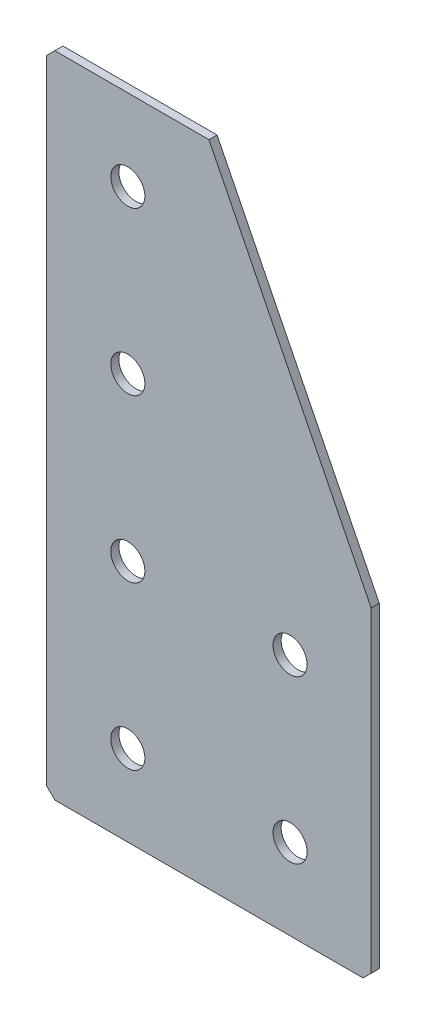
ISO-10303-21;
HEADER;
FILE_DESCRIPTION(('STEP AP214'),'2;1');
FILE_NAME('part.step','',(''),(''),'','','');
FILE_SCHEMA(('AUTOMOTIVE_DESIGN { 1 0 10303 214 1 1 1 1 }'));
ENDSEC;
DATA;
#1=APPLICATION_CONTEXT('core data for automotive mechanical design processes');
#2=APPLICATION_PROTOCOL_DEFINITION('international standard','automotive_design',2000,#1);
#3=PRODUCT_CONTEXT('',#1,'mechanical');
#4=PRODUCT('Part','Part','',(#3));
#5=PRODUCT_RELATED_PRODUCT_CATEGORY('part','',(#4));
#6=PRODUCT_DEFINITION_FORMATION('','',#4);
#7=PRODUCT_DEFINITION_CONTEXT('part definition',#1,'design');
#8=PRODUCT_DEFINITION('design','',#6,#7);
#9=PRODUCT_DEFINITION_SHAPE('','',#8);
#10=(LENGTH_UNIT() NAMED_UNIT(*) SI_UNIT(.MILLI.,.METRE.));
#11=(NAMED_UNIT(*) PLANE_ANGLE_UNIT() SI_UNIT($,.RADIAN.));
#12=(NAMED_UNIT(*) SI_UNIT($,.STERADIAN.) SOLID_ANGLE_UNIT());
#13=UNCERTAINTY_MEASURE_WITH_UNIT(LENGTH_MEASURE(1.E-05),#10,'distance_accuracy_value','');
#14=(GEOMETRIC_REPRESENTATION_CONTEXT(3) GLOBAL_UNCERTAINTY_ASSIGNED_CONTEXT((#13)) GLOBAL_UNIT_ASSIGNED_CONTEXT((#10,
#11,#12)) REPRESENTATION_CONTEXT('',''));
#15=CARTESIAN_POINT('',(0.,0.,0.));
#16=DIRECTION('',(0.,0.,1.));
#17=DIRECTION('',(1.,0.,0.));
#18=AXIS2_PLACEMENT_3D('',#15,#16,#17);
#19=CARTESIAN_POINT('',(0.,0.,-2.));
#20=DIRECTION('',(0.,0.,1.));
#21=DIRECTION('',(1.,0.,0.));
#22=AXIS2_PLACEMENT_3D('',#19,#20,#21);
#23=PLANE('',#22);
#24=CARTESIAN_POINT('',(20.,-100.,-2.00000000000001));
#25=DIRECTION('',(0.,0.,-1.));
#26=DIRECTION('',(0.,1.,0.));
#27=AXIS2_PLACEMENT_3D('',#24,#25,#26);
#28=CIRCLE('',#27,4.2);
#29=CARTESIAN_POINT('',(20.,-95.8,-2.00000000000001));
#30=VERTEX_POINT('',#29);
#31=EDGE_CURVE('E200',#30,#30,#28,.T.);
#32=ORIENTED_EDGE('',*,*,#31,.F.);
#33=EDGE_LOOP('',(#32));
#34=FACE_BOUND('',#33,.T.);
#35=CARTESIAN_POINT('',(20.,-60.,-2.));
#36=DIRECTION('',(0.,0.,-1.));
#37=DIRECTION('',(0.,1.,0.));
#38=AXIS2_PLACEMENT_3D('',#35,#36,#37);
#39=CIRCLE('',#38,4.2);
#40=CARTESIAN_POINT('',(20.,-55.8,-2.));
#41=VERTEX_POINT('',#40);
#42=EDGE_CURVE('E194',#41,#41,#39,.T.);
#43=ORIENTED_EDGE('',*,*,#42,.F.);
#44=EDGE_LOOP('',(#43));
#45=FACE_BOUND('',#44,.T.);
#46=CARTESIAN_POINT('',(20.,-20.,-2.));
#47=DIRECTION('',(0.,0.,-1.));
#48=DIRECTION('',(0.,1.,0.));
#49=AXIS2_PLACEMENT_3D('',#46,#47,#48);
#50=CIRCLE('',#49,4.2);
#51=CARTESIAN_POINT('',(20.,-15.8,-2.));
#52=VERTEX_POINT('',#51);
#53=EDGE_CURVE('E188',#52,#52,#50,.T.);
#54=ORIENTED_EDGE('',*,*,#53,.F.);
#55=EDGE_LOOP('',(#54));
#56=FACE_BOUND('',#55,.T.);
#57=CARTESIAN_POINT('',(60.,-140.,-2.00000000000001));
#58=DIRECTION('',(0.,0.,-1.));
#59=DIRECTION('',(0.,1.,0.));
#60=AXIS2_PLACEMENT_3D('',#57,#58,#59);
#61=CIRCLE('',#60,4.2);
#62=CARTESIAN_POINT('',(60.,-135.8,-2.00000000000001));
#63=VERTEX_POINT('',#62);
#64=EDGE_CURVE('E182',#63,#63,#61,.T.);
#65=ORIENTED_EDGE('',*,*,#64,.F.);
#66=EDGE_LOOP('',(#65));
#67=FACE_BOUND('',#66,.T.);
#68=CARTESIAN_POINT('',(60.,-100.,-2.00000000000001));
#69=DIRECTION('',(0.,0.,-1.));
#70=DIRECTION('',(0.,1.,0.));
#71=AXIS2_PLACEMENT_3D('',#68,#69,#70);
#72=CIRCLE('',#71,4.2);
#73=CARTESIAN_POINT('',(60.,-95.8,-2.00000000000001));
#74=VERTEX_POINT('',#73);
#75=EDGE_CURVE('E176',#74,#74,#72,.T.);
#76=ORIENTED_EDGE('',*,*,#75,.F.);
#77=EDGE_LOOP('',(#76));
#78=FACE_BOUND('',#77,.T.);
#79=DIRECTION('',(0.,1.,0.));
#80=VECTOR('',#79,1.);
#81=CARTESIAN_POINT('',(0.,0.,-2.));
#82=LINE('',#81,#80);
#83=CARTESIAN_POINT('',(0.,-158.,-2.));
#84=VERTEX_POINT('',#83);
#85=CARTESIAN_POINT('',(0.,-2.00000000000003,-2.));
#86=VERTEX_POINT('',#85);
#87=EDGE_CURVE('E132',#84,#86,#82,.T.);
#88=ORIENTED_EDGE('',*,*,#87,.T.);
#89=DIRECTION('',(-0.707106781186543,-0.707106781186552,0.));
#90=VECTOR('',#89,1.);
#91=CARTESIAN_POINT('',(2.,0.,-2.));
#92=LINE('',#91,#90);
#93=CARTESIAN_POINT('',(2.,0.,-2.));
#94=VERTEX_POINT('',#93);
#95=EDGE_CURVE('E108',#86,#94,#92,.F.);
#96=ORIENTED_EDGE('',*,*,#95,.T.);
#97=DIRECTION('',(1.,0.,0.));
#98=VECTOR('',#97,1.);
#99=CARTESIAN_POINT('',(40.,0.,-2.));
#100=LINE('',#99,#98);
#101=CARTESIAN_POINT('',(40.,0.,-2.));
#102=VERTEX_POINT('',#101);
#103=EDGE_CURVE('E101',#94,#102,#100,.T.);
#104=ORIENTED_EDGE('',*,*,#103,.T.);
#105=DIRECTION('',(0.447213595499958,-0.894427190999916,0.));
#106=VECTOR('',#105,1.);
#107=CARTESIAN_POINT('',(80.,-80.,-2.));
#108=LINE('',#107,#106);
#109=CARTESIAN_POINT('',(80.,-80.,-2.));
#110=VERTEX_POINT('',#109);
#111=EDGE_CURVE('E105',#102,#110,#108,.T.);
#112=ORIENTED_EDGE('',*,*,#111,.T.);
#113=DIRECTION('',(0.,-1.,0.));
#114=VECTOR('',#113,1.);
#115=CARTESIAN_POINT('',(80.,-160.,-2.));
#116=LINE('',#115,#114);
#117=CARTESIAN_POINT('',(80.,-158.,-2.));
#118=VERTEX_POINT('',#117);
#119=EDGE_CURVE('E122',#110,#118,#116,.T.);
#120=ORIENTED_EDGE('',*,*,#119,.T.);
#121=DIRECTION('',(0.707106781186548,0.707106781186548,0.));
#122=VECTOR('',#121,1.);
#123=CARTESIAN_POINT('',(78.,-160.,-2.));
#124=LINE('',#123,#122);
#125=CARTESIAN_POINT('',(78.,-160.,-2.));
#126=VERTEX_POINT('',#125);
#127=EDGE_CURVE('E59',#118,#126,#124,.F.);
#128=ORIENTED_EDGE('',*,*,#127,.T.);
#129=DIRECTION('',(-1.,0.,0.));
#130=VECTOR('',#129,1.);
#131=CARTESIAN_POINT('',(0.,-160.,-2.));
#132=LINE('',#131,#130);
#133=CARTESIAN_POINT('',(2.00000000000003,-160.,-2.));
#134=VERTEX_POINT('',#133);
#135=EDGE_CURVE('E155',#126,#134,#132,.T.);
#136=ORIENTED_EDGE('',*,*,#135,.T.);
#137=DIRECTION('',(0.707106781186548,-0.707106781186548,0.));
#138=VECTOR('',#137,1.);
#139=CARTESIAN_POINT('',(0.,-158.,-2.));
#140=LINE('',#139,#138);
#141=EDGE_CURVE('E146',#134,#84,#140,.F.);
#142=ORIENTED_EDGE('',*,*,#141,.T.);
#143=EDGE_LOOP('',(#88,#96,#104,#112,#120,#128,#136,#142));
#144=FACE_BOUND('',#143,.T.);
#145=CARTESIAN_POINT('',(20.,-140.,-2.00000000000001));
#146=DIRECTION('',(0.,0.,-1.));
#147=DIRECTION('',(0.,1.,0.));
#148=AXIS2_PLACEMENT_3D('',#145,#146,#147);
#149=CIRCLE('',#148,4.2);
#150=CARTESIAN_POINT('',(20.,-135.8,-2.00000000000001));
#151=VERTEX_POINT('',#150);
#152=EDGE_CURVE('E206',#151,#151,#149,.T.);
#153=ORIENTED_EDGE('',*,*,#152,.F.);
#154=EDGE_LOOP('',(#153));
#155=FACE_BOUND('',#154,.T.);
#156=ADVANCED_FACE('F37',(#34,#45,#56,#67,#78,#144,#155),#23,.F.);
#157=CARTESIAN_POINT('',(40.,0.,-2.));
#158=DIRECTION('',(0.,-1.,0.));
#159=DIRECTION('',(1.,0.,0.));
#160=AXIS2_PLACEMENT_3D('',#157,#158,#159);
#161=PLANE('',#160);
#162=ORIENTED_EDGE('',*,*,#103,.F.);
#163=DIRECTION('',(0.,0.,1.));
#164=VECTOR('',#163,1.);
#165=CARTESIAN_POINT('',(2.,0.,-2.));
#166=LINE('',#165,#164);
#167=CARTESIAN_POINT('',(2.,0.,0.));
#168=VERTEX_POINT('',#167);
#169=EDGE_CURVE('E128',#94,#168,#166,.T.);
#170=ORIENTED_EDGE('',*,*,#169,.T.);
#171=DIRECTION('',(1.,0.,0.));
#172=VECTOR('',#171,1.);
#173=CARTESIAN_POINT('',(40.,0.,0.));
#174=LINE('',#173,#172);
#175=CARTESIAN_POINT('',(40.,0.,0.));
#176=VERTEX_POINT('',#175);
#177=EDGE_CURVE('E126',#168,#176,#174,.T.);
#178=ORIENTED_EDGE('',*,*,#177,.T.);
#179=DIRECTION('',(0.,0.,1.));
#180=VECTOR('',#179,1.);
#181=CARTESIAN_POINT('',(40.,0.,-2.));
#182=LINE('',#181,#180);
#183=EDGE_CURVE('E118',#102,#176,#182,.T.);
#184=ORIENTED_EDGE('',*,*,#183,.F.);
#185=EDGE_LOOP('',(#162,#170,#178,#184));
#186=FACE_BOUND('',#185,.T.);
#187=ADVANCED_FACE('F124',(#186),#161,.F.);
#188=CARTESIAN_POINT('',(80.,-80.,-2.));
#189=DIRECTION('',(-0.894427190999916,-0.447213595499958,0.));
#190=DIRECTION('',(0.447213595499958,-0.894427190999916,0.));
#191=AXIS2_PLACEMENT_3D('',#188,#189,#190);
#192=PLANE('',#191);
#193=DIRECTION('',(0.447213595499958,-0.894427190999916,0.));
#194=VECTOR('',#193,1.);
#195=CARTESIAN_POINT('',(80.,-80.,0.));
#196=LINE('',#195,#194);
#197=CARTESIAN_POINT('',(80.,-80.,0.));
#198=VERTEX_POINT('',#197);
#199=EDGE_CURVE('E165',#176,#198,#196,.T.);
#200=ORIENTED_EDGE('',*,*,#199,.T.);
#201=DIRECTION('',(0.,0.,1.));
#202=VECTOR('',#201,1.);
#203=CARTESIAN_POINT('',(80.,-80.,-2.));
#204=LINE('',#203,#202);
#205=EDGE_CURVE('E120',#110,#198,#204,.T.);
#206=ORIENTED_EDGE('',*,*,#205,.F.);
#207=ORIENTED_EDGE('',*,*,#111,.F.);
#208=ORIENTED_EDGE('',*,*,#183,.T.);
#209=EDGE_LOOP('',(#200,#206,#207,#208));
#210=FACE_BOUND('',#209,.T.);
#211=ADVANCED_FACE('F117',(#210),#192,.F.);
#212=CARTESIAN_POINT('',(80.,-160.,-2.));
#213=DIRECTION('',(-1.,0.,0.));
#214=DIRECTION('',(0.,-1.,0.));
#215=AXIS2_PLACEMENT_3D('',#212,#213,#214);
#216=PLANE('',#215);
#217=DIRECTION('',(0.,-1.,0.));
#218=VECTOR('',#217,1.);
#219=CARTESIAN_POINT('',(80.,-160.,0.));
#220=LINE('',#219,#218);
#221=CARTESIAN_POINT('',(80.,-158.,0.));
#222=VERTEX_POINT('',#221);
#223=EDGE_CURVE('E162',#198,#222,#220,.T.);
#224=ORIENTED_EDGE('',*,*,#223,.T.);
#225=DIRECTION('',(0.,0.,-1.));
#226=VECTOR('',#225,1.);
#227=CARTESIAN_POINT('',(80.,-158.,-2.));
#228=LINE('',#227,#226);
#229=EDGE_CURVE('E11',#222,#118,#228,.T.);
#230=ORIENTED_EDGE('',*,*,#229,.T.);
#231=ORIENTED_EDGE('',*,*,#119,.F.);
#232=ORIENTED_EDGE('',*,*,#205,.T.);
#233=EDGE_LOOP('',(#224,#230,#231,#232));
#234=FACE_BOUND('',#233,.T.);
#235=ADVANCED_FACE('F234',(#234),#216,.F.);
#236=CARTESIAN_POINT('',(0.,-160.,-2.));
#237=DIRECTION('',(0.,1.,0.));
#238=DIRECTION('',(0.,0.,1.));
#239=AXIS2_PLACEMENT_3D('',#236,#237,#238);
#240=PLANE('',#239);
#241=ORIENTED_EDGE('',*,*,#135,.F.);
#242=DIRECTION('',(0.,0.,1.));
#243=VECTOR('',#242,1.);
#244=CARTESIAN_POINT('',(78.,-160.,-2.));
#245=LINE('',#244,#243);
#246=CARTESIAN_POINT('',(78.,-160.,0.));
#247=VERTEX_POINT('',#246);
#248=EDGE_CURVE('E45',#126,#247,#245,.T.);
#249=ORIENTED_EDGE('',*,*,#248,.T.);
#250=DIRECTION('',(-1.,0.,0.));
#251=VECTOR('',#250,1.);
#252=CARTESIAN_POINT('',(0.,-160.,0.));
#253=LINE('',#252,#251);
#254=CARTESIAN_POINT('',(2.00000000000003,-160.,0.));
#255=VERTEX_POINT('',#254);
#256=EDGE_CURVE('E154',#247,#255,#253,.T.);
#257=ORIENTED_EDGE('',*,*,#256,.T.);
#258=DIRECTION('',(0.,0.,-1.));
#259=VECTOR('',#258,1.);
#260=CARTESIAN_POINT('',(2.00000000000003,-160.,-2.));
#261=LINE('',#260,#259);
#262=EDGE_CURVE('E52',#255,#134,#261,.T.);
#263=ORIENTED_EDGE('',*,*,#262,.T.);
#264=EDGE_LOOP('',(#241,#249,#257,#263));
#265=FACE_BOUND('',#264,.T.);
#266=ADVANCED_FACE('F153',(#265),#240,.F.);
#267=CARTESIAN_POINT('',(0.,0.,-2.));
#268=DIRECTION('',(1.,0.,0.));
#269=DIRECTION('',(0.,0.,-1.));
#270=AXIS2_PLACEMENT_3D('',#267,#268,#269);
#271=PLANE('',#270);
#272=DIRECTION('',(0.,1.,0.));
#273=VECTOR('',#272,1.);
#274=CARTESIAN_POINT('',(0.,0.,0.));
#275=LINE('',#274,#273);
#276=CARTESIAN_POINT('',(0.,-158.,0.));
#277=VERTEX_POINT('',#276);
#278=CARTESIAN_POINT('',(0.,-2.00000000000003,0.));
#279=VERTEX_POINT('',#278);
#280=EDGE_CURVE('E113',#277,#279,#275,.T.);
#281=ORIENTED_EDGE('',*,*,#280,.T.);
#282=DIRECTION('',(0.,0.,-1.));
#283=VECTOR('',#282,1.);
#284=CARTESIAN_POINT('',(0.,-2.00000000000003,-2.));
#285=LINE('',#284,#283);
#286=EDGE_CURVE('E144',#279,#86,#285,.T.);
#287=ORIENTED_EDGE('',*,*,#286,.T.);
#288=ORIENTED_EDGE('',*,*,#87,.F.);
#289=DIRECTION('',(0.,0.,1.));
#290=VECTOR('',#289,1.);
#291=CARTESIAN_POINT('',(0.,-158.,-2.));
#292=LINE('',#291,#290);
#293=EDGE_CURVE('E141',#84,#277,#292,.T.);
#294=ORIENTED_EDGE('',*,*,#293,.T.);
#295=EDGE_LOOP('',(#281,#287,#288,#294));
#296=FACE_BOUND('',#295,.T.);
#297=ADVANCED_FACE('F227',(#296),#271,.F.);
#298=CARTESIAN_POINT('',(0.,0.,0.));
#299=DIRECTION('',(0.,0.,1.));
#300=DIRECTION('',(1.,0.,0.));
#301=AXIS2_PLACEMENT_3D('',#298,#299,#300);
#302=PLANE('',#301);
#303=CARTESIAN_POINT('',(20.,-140.,0.));
#304=DIRECTION('',(0.,0.,1.));
#305=DIRECTION('',(1.,0.,0.));
#306=AXIS2_PLACEMENT_3D('',#303,#304,#305);
#307=CIRCLE('',#306,4.2);
#308=CARTESIAN_POINT('',(24.2,-140.,0.));
#309=VERTEX_POINT('',#308);
#310=EDGE_CURVE('E203',#309,#309,#307,.T.);
#311=ORIENTED_EDGE('',*,*,#310,.F.);
#312=EDGE_LOOP('',(#311));
#313=FACE_BOUND('',#312,.T.);
#314=CARTESIAN_POINT('',(20.,-100.,0.));
#315=DIRECTION('',(0.,0.,1.));
#316=DIRECTION('',(1.,0.,0.));
#317=AXIS2_PLACEMENT_3D('',#314,#315,#316);
#318=CIRCLE('',#317,4.2);
#319=CARTESIAN_POINT('',(24.2,-100.,0.));
#320=VERTEX_POINT('',#319);
#321=EDGE_CURVE('E197',#320,#320,#318,.T.);
#322=ORIENTED_EDGE('',*,*,#321,.F.);
#323=EDGE_LOOP('',(#322));
#324=FACE_BOUND('',#323,.T.);
#325=CARTESIAN_POINT('',(20.,-60.,0.));
#326=DIRECTION('',(0.,0.,1.));
#327=DIRECTION('',(1.,0.,0.));
#328=AXIS2_PLACEMENT_3D('',#325,#326,#327);
#329=CIRCLE('',#328,4.2);
#330=CARTESIAN_POINT('',(24.2,-60.,0.));
#331=VERTEX_POINT('',#330);
#332=EDGE_CURVE('E191',#331,#331,#329,.T.);
#333=ORIENTED_EDGE('',*,*,#332,.F.);
#334=EDGE_LOOP('',(#333));
#335=FACE_BOUND('',#334,.T.);
#336=CARTESIAN_POINT('',(20.,-20.,0.));
#337=DIRECTION('',(0.,0.,1.));
#338=DIRECTION('',(1.,0.,0.));
#339=AXIS2_PLACEMENT_3D('',#336,#337,#338);
#340=CIRCLE('',#339,4.2);
#341=CARTESIAN_POINT('',(24.2,-20.,0.));
#342=VERTEX_POINT('',#341);
#343=EDGE_CURVE('E185',#342,#342,#340,.T.);
#344=ORIENTED_EDGE('',*,*,#343,.F.);
#345=EDGE_LOOP('',(#344));
#346=FACE_BOUND('',#345,.T.);
#347=CARTESIAN_POINT('',(60.,-140.,0.));
#348=DIRECTION('',(0.,0.,1.));
#349=DIRECTION('',(1.,0.,0.));
#350=AXIS2_PLACEMENT_3D('',#347,#348,#349);
#351=CIRCLE('',#350,4.2);
#352=CARTESIAN_POINT('',(64.2,-140.,0.));
#353=VERTEX_POINT('',#352);
#354=EDGE_CURVE('E179',#353,#353,#351,.T.);
#355=ORIENTED_EDGE('',*,*,#354,.F.);
#356=EDGE_LOOP('',(#355));
#357=FACE_BOUND('',#356,.T.);
#358=CARTESIAN_POINT('',(60.,-100.,0.));
#359=DIRECTION('',(0.,0.,1.));
#360=DIRECTION('',(1.,0.,0.));
#361=AXIS2_PLACEMENT_3D('',#358,#359,#360);
#362=CIRCLE('',#361,4.2);
#363=CARTESIAN_POINT('',(64.2,-100.,0.));
#364=VERTEX_POINT('',#363);
#365=EDGE_CURVE('E170',#364,#364,#362,.T.);
#366=ORIENTED_EDGE('',*,*,#365,.F.);
#367=EDGE_LOOP('',(#366));
#368=FACE_BOUND('',#367,.T.);
#369=ORIENTED_EDGE('',*,*,#177,.F.);
#370=DIRECTION('',(0.707106781186543,0.707106781186552,0.));
#371=VECTOR('',#370,1.);
#372=CARTESIAN_POINT('',(1.00000000000001,-1.,0.));
#373=LINE('',#372,#371);
#374=EDGE_CURVE('E139',#168,#279,#373,.F.);
#375=ORIENTED_EDGE('',*,*,#374,.T.);
#376=ORIENTED_EDGE('',*,*,#280,.F.);
#377=DIRECTION('',(-0.707106781186548,0.707106781186548,0.));
#378=VECTOR('',#377,1.);
#379=CARTESIAN_POINT('',(-79.,-79.,0.));
#380=LINE('',#379,#378);
#381=EDGE_CURVE('E130',#277,#255,#380,.F.);
#382=ORIENTED_EDGE('',*,*,#381,.T.);
#383=ORIENTED_EDGE('',*,*,#256,.F.);
#384=DIRECTION('',(-0.707106781186548,-0.707106781186548,0.));
#385=VECTOR('',#384,1.);
#386=CARTESIAN_POINT('',(119.,-119.,0.));
#387=LINE('',#386,#385);
#388=EDGE_CURVE('E137',#247,#222,#387,.F.);
#389=ORIENTED_EDGE('',*,*,#388,.T.);
#390=ORIENTED_EDGE('',*,*,#223,.F.);
#391=ORIENTED_EDGE('',*,*,#199,.F.);
#392=EDGE_LOOP('',(#369,#375,#376,#382,#383,#389,#390,#391));
#393=FACE_BOUND('',#392,.T.);
#394=ADVANCED_FACE('F158',(#313,#324,#335,#346,#357,#368,#393),#302,.T.);
#395=CARTESIAN_POINT('',(60.,-100.,-2.00000000000001));
#396=DIRECTION('',(0.,0.,-1.));
#397=DIRECTION('',(0.,1.,0.));
#398=AXIS2_PLACEMENT_3D('',#395,#396,#397);
#399=CYLINDRICAL_SURFACE('',#398,4.2);
#400=ORIENTED_EDGE('',*,*,#75,.T.);
#401=EDGE_LOOP('',(#400));
#402=FACE_BOUND('',#401,.T.);
#403=ORIENTED_EDGE('',*,*,#365,.T.);
#404=EDGE_LOOP('',(#403));
#405=FACE_BOUND('',#404,.T.);
#406=ADVANCED_FACE('F223',(#402,#405),#399,.F.);
#407=CARTESIAN_POINT('',(60.,-140.,-2.00000000000001));
#408=DIRECTION('',(0.,0.,-1.));
#409=DIRECTION('',(0.,1.,0.));
#410=AXIS2_PLACEMENT_3D('',#407,#408,#409);
#411=CYLINDRICAL_SURFACE('',#410,4.2);
#412=ORIENTED_EDGE('',*,*,#64,.T.);
#413=EDGE_LOOP('',(#412));
#414=FACE_BOUND('',#413,.T.);
#415=ORIENTED_EDGE('',*,*,#354,.T.);
#416=EDGE_LOOP('',(#415));
#417=FACE_BOUND('',#416,.T.);
#418=ADVANCED_FACE('F341',(#414,#417),#411,.F.);
#419=CARTESIAN_POINT('',(20.,-20.,-2.));
#420=DIRECTION('',(0.,0.,-1.));
#421=DIRECTION('',(0.,1.,0.));
#422=AXIS2_PLACEMENT_3D('',#419,#420,#421);
#423=CYLINDRICAL_SURFACE('',#422,4.2);
#424=ORIENTED_EDGE('',*,*,#53,.T.);
#425=EDGE_LOOP('',(#424));
#426=FACE_BOUND('',#425,.T.);
#427=ORIENTED_EDGE('',*,*,#343,.T.);
#428=EDGE_LOOP('',(#427));
#429=FACE_BOUND('',#428,.T.);
#430=ADVANCED_FACE('F331',(#426,#429),#423,.F.);
#431=CARTESIAN_POINT('',(20.,-60.,-2.));
#432=DIRECTION('',(0.,0.,-1.));
#433=DIRECTION('',(0.,1.,0.));
#434=AXIS2_PLACEMENT_3D('',#431,#432,#433);
#435=CYLINDRICAL_SURFACE('',#434,4.2);
#436=ORIENTED_EDGE('',*,*,#42,.T.);
#437=EDGE_LOOP('',(#436));
#438=FACE_BOUND('',#437,.T.);
#439=ORIENTED_EDGE('',*,*,#332,.T.);
#440=EDGE_LOOP('',(#439));
#441=FACE_BOUND('',#440,.T.);
#442=ADVANCED_FACE('F321',(#438,#441),#435,.F.);
#443=CARTESIAN_POINT('',(20.,-100.,-2.00000000000001));
#444=DIRECTION('',(0.,0.,-1.));
#445=DIRECTION('',(0.,1.,0.));
#446=AXIS2_PLACEMENT_3D('',#443,#444,#445);
#447=CYLINDRICAL_SURFACE('',#446,4.2);
#448=ORIENTED_EDGE('',*,*,#31,.T.);
#449=EDGE_LOOP('',(#448));
#450=FACE_BOUND('',#449,.T.);
#451=ORIENTED_EDGE('',*,*,#321,.T.);
#452=EDGE_LOOP('',(#451));
#453=FACE_BOUND('',#452,.T.);
#454=ADVANCED_FACE('F312',(#450,#453),#447,.F.);
#455=CARTESIAN_POINT('',(20.,-140.,-2.00000000000001));
#456=DIRECTION('',(0.,0.,-1.));
#457=DIRECTION('',(0.,1.,0.));
#458=AXIS2_PLACEMENT_3D('',#455,#456,#457);
#459=CYLINDRICAL_SURFACE('',#458,4.2);
#460=ORIENTED_EDGE('',*,*,#152,.T.);
#461=EDGE_LOOP('',(#460));
#462=FACE_BOUND('',#461,.T.);
#463=ORIENTED_EDGE('',*,*,#310,.T.);
#464=EDGE_LOOP('',(#463));
#465=FACE_BOUND('',#464,.T.);
#466=ADVANCED_FACE('F210',(#462,#465),#459,.F.);
#467=CARTESIAN_POINT('',(2.,0.,-2.));
#468=DIRECTION('',(0.707106781186552,-0.707106781186542,0.));
#469=DIRECTION('',(0.,0.,1.));
#470=AXIS2_PLACEMENT_3D('',#467,#468,#469);
#471=PLANE('',#470);
#472=ORIENTED_EDGE('',*,*,#95,.F.);
#473=ORIENTED_EDGE('',*,*,#286,.F.);
#474=ORIENTED_EDGE('',*,*,#374,.F.);
#475=ORIENTED_EDGE('',*,*,#169,.F.);
#476=EDGE_LOOP('',(#472,#473,#474,#475));
#477=FACE_BOUND('',#476,.T.);
#478=ADVANCED_FACE('F240',(#477),#471,.F.);
#479=CARTESIAN_POINT('',(78.,-160.,-2.));
#480=DIRECTION('',(-0.707106781186547,0.707106781186547,0.));
#481=DIRECTION('',(0.,0.,1.));
#482=AXIS2_PLACEMENT_3D('',#479,#480,#481);
#483=PLANE('',#482);
#484=ORIENTED_EDGE('',*,*,#127,.F.);
#485=ORIENTED_EDGE('',*,*,#229,.F.);
#486=ORIENTED_EDGE('',*,*,#388,.F.);
#487=ORIENTED_EDGE('',*,*,#248,.F.);
#488=EDGE_LOOP('',(#484,#485,#486,#487));
#489=FACE_BOUND('',#488,.T.);
#490=ADVANCED_FACE('F242',(#489),#483,.F.);
#491=CARTESIAN_POINT('',(0.,-158.,-2.));
#492=DIRECTION('',(0.707106781186547,0.707106781186547,0.));
#493=DIRECTION('',(0.,0.,1.));
#494=AXIS2_PLACEMENT_3D('',#491,#492,#493);
#495=PLANE('',#494);
#496=ORIENTED_EDGE('',*,*,#141,.F.);
#497=ORIENTED_EDGE('',*,*,#262,.F.);
#498=ORIENTED_EDGE('',*,*,#381,.F.);
#499=ORIENTED_EDGE('',*,*,#293,.F.);
#500=EDGE_LOOP('',(#496,#497,#498,#499));
#501=FACE_BOUND('',#500,.T.);
#502=ADVANCED_FACE('F39',(#501),#495,.F.);
#503=CLOSED_SHELL('',(#156,#187,#211,#235,#266,#297,#394,#406,#418,#430,#442,#454,#466,#478,
#490,#502));
#504=MANIFOLD_SOLID_BREP('B2',#503);
#505=ADVANCED_BREP_SHAPE_REPRESENTATION('',(#18,#504),#14);
#506=SHAPE_DEFINITION_REPRESENTATION(#9,#505);
ENDSEC;
END-ISO-10303-21;
